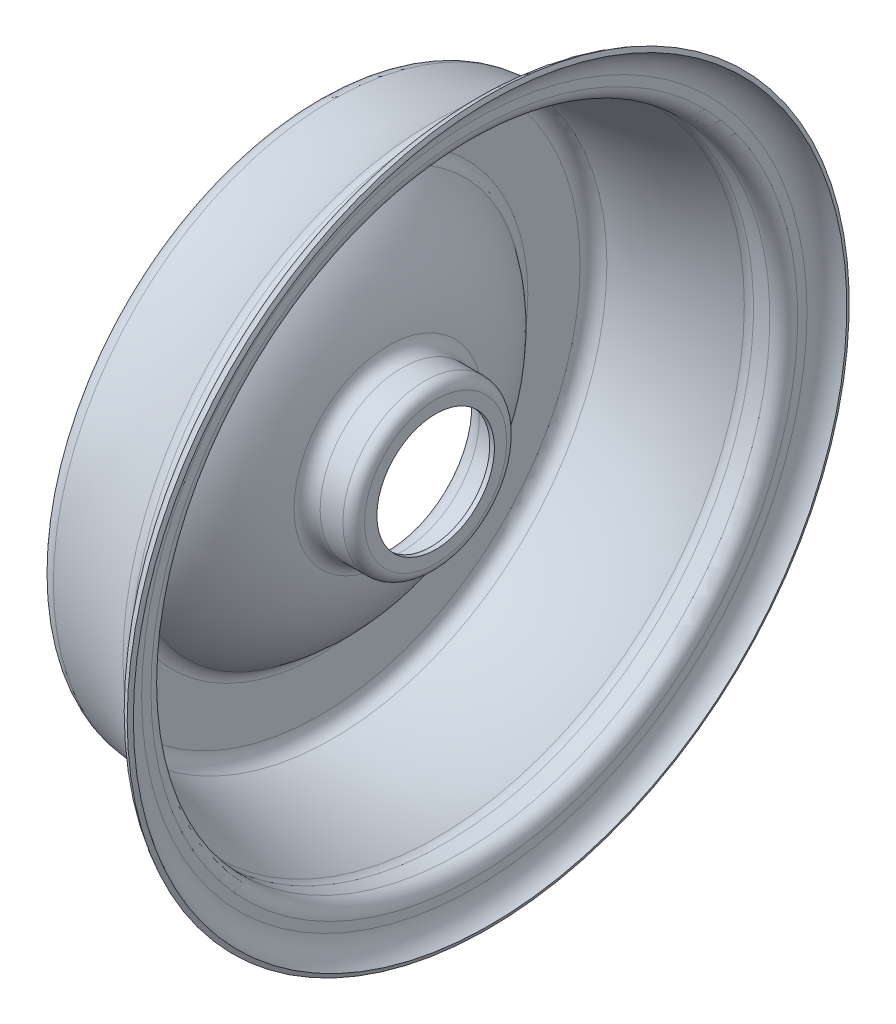
ISO-10303-21;
HEADER;
FILE_DESCRIPTION(('STEP AP214'),'2;1');
FILE_NAME('part.step','',(''),(''),'','','');
FILE_SCHEMA(('AUTOMOTIVE_DESIGN { 1 0 10303 214 1 1 1 1 }'));
ENDSEC;
DATA;
#1=APPLICATION_CONTEXT('core data for automotive mechanical design processes');
#2=APPLICATION_PROTOCOL_DEFINITION('international standard','automotive_design',2000,#1);
#3=PRODUCT_CONTEXT('',#1,'mechanical');
#4=PRODUCT('Part','Part','',(#3));
#5=PRODUCT_RELATED_PRODUCT_CATEGORY('part','',(#4));
#6=PRODUCT_DEFINITION_FORMATION('','',#4);
#7=PRODUCT_DEFINITION_CONTEXT('part definition',#1,'design');
#8=PRODUCT_DEFINITION('design','',#6,#7);
#9=PRODUCT_DEFINITION_SHAPE('','',#8);
#10=(LENGTH_UNIT() NAMED_UNIT(*) SI_UNIT(.MILLI.,.METRE.));
#11=(NAMED_UNIT(*) PLANE_ANGLE_UNIT() SI_UNIT($,.RADIAN.));
#12=(NAMED_UNIT(*) SI_UNIT($,.STERADIAN.) SOLID_ANGLE_UNIT());
#13=UNCERTAINTY_MEASURE_WITH_UNIT(LENGTH_MEASURE(1.E-05),#10,'distance_accuracy_value','');
#14=(GEOMETRIC_REPRESENTATION_CONTEXT(3) GLOBAL_UNCERTAINTY_ASSIGNED_CONTEXT((#13)) GLOBAL_UNIT_ASSIGNED_CONTEXT((#10,
#11,#12)) REPRESENTATION_CONTEXT('',''));
#15=CARTESIAN_POINT('',(0.,0.,0.));
#16=DIRECTION('',(0.,0.,1.));
#17=DIRECTION('',(1.,0.,0.));
#18=AXIS2_PLACEMENT_3D('',#15,#16,#17);
#19=CARTESIAN_POINT('',(0.,0.,0.));
#20=DIRECTION('',(-1.,0.,0.));
#21=DIRECTION('',(0.,0.,1.));
#22=AXIS2_PLACEMENT_3D('',#19,#20,#21);
#23=CYLINDRICAL_SURFACE('',#22,19.);
#24=CARTESIAN_POINT('',(39.,0.,0.));
#25=DIRECTION('',(-1.,0.,0.));
#26=DIRECTION('',(0.,0.,1.));
#27=AXIS2_PLACEMENT_3D('',#24,#25,#26);
#28=CIRCLE('',#27,19.);
#29=CARTESIAN_POINT('',(39.,0.,19.));
#30=VERTEX_POINT('',#29);
#31=EDGE_CURVE('E10',#30,#30,#28,.T.);
#32=ORIENTED_EDGE('',*,*,#31,.F.);
#33=EDGE_LOOP('',(#32));
#34=FACE_BOUND('',#33,.T.);
#35=CARTESIAN_POINT('',(37.5,0.,0.));
#36=DIRECTION('',(-1.,0.,0.));
#37=DIRECTION('',(0.,0.,1.));
#38=AXIS2_PLACEMENT_3D('',#35,#36,#37);
#39=CIRCLE('',#38,19.);
#40=CARTESIAN_POINT('',(37.5,0.,19.));
#41=VERTEX_POINT('',#40);
#42=EDGE_CURVE('E129',#41,#41,#39,.T.);
#43=ORIENTED_EDGE('',*,*,#42,.T.);
#44=EDGE_LOOP('',(#43));
#45=FACE_BOUND('',#44,.T.);
#46=ADVANCED_FACE('F35',(#34,#45),#23,.F.);
#47=CARTESIAN_POINT('',(39.,19.,0.));
#48=DIRECTION('',(-1.,0.,0.));
#49=DIRECTION('',(0.,0.,1.));
#50=AXIS2_PLACEMENT_3D('',#47,#48,#49);
#51=PLANE('',#50);
#52=CARTESIAN_POINT('',(39.,0.,0.));
#53=DIRECTION('',(-1.,0.,0.));
#54=DIRECTION('',(0.,0.,1.));
#55=AXIS2_PLACEMENT_3D('',#52,#53,#54);
#56=CIRCLE('',#55,23.);
#57=CARTESIAN_POINT('',(39.,0.,23.));
#58=VERTEX_POINT('',#57);
#59=EDGE_CURVE('E41',#58,#58,#56,.T.);
#60=ORIENTED_EDGE('',*,*,#59,.F.);
#61=EDGE_LOOP('',(#60));
#62=FACE_BOUND('',#61,.T.);
#63=ORIENTED_EDGE('',*,*,#31,.T.);
#64=EDGE_LOOP('',(#63));
#65=FACE_BOUND('',#64,.T.);
#66=ADVANCED_FACE('F298',(#62,#65),#51,.F.);
#67=CARTESIAN_POINT('',(35.5,0.,0.));
#68=DIRECTION('',(-1.,0.,0.));
#69=DIRECTION('',(0.,0.,1.));
#70=AXIS2_PLACEMENT_3D('',#67,#68,#69);
#71=TOROIDAL_SURFACE('',#70,23.,3.5);
#72=CARTESIAN_POINT('',(35.5,0.,0.));
#73=DIRECTION('',(-1.,0.,0.));
#74=DIRECTION('',(0.,0.,1.));
#75=AXIS2_PLACEMENT_3D('',#72,#73,#74);
#76=CIRCLE('',#75,26.5);
#77=CARTESIAN_POINT('',(35.5,0.,26.5));
#78=VERTEX_POINT('',#77);
#79=EDGE_CURVE('E45',#78,#78,#76,.T.);
#80=ORIENTED_EDGE('',*,*,#79,.F.);
#81=EDGE_LOOP('',(#80));
#82=FACE_BOUND('',#81,.T.);
#83=ORIENTED_EDGE('',*,*,#59,.T.);
#84=EDGE_LOOP('',(#83));
#85=FACE_BOUND('',#84,.T.);
#86=ADVANCED_FACE('F293',(#82,#85),#71,.T.);
#87=CARTESIAN_POINT('',(0.,0.,0.));
#88=DIRECTION('',(-1.,0.,0.));
#89=DIRECTION('',(0.,0.,1.));
#90=AXIS2_PLACEMENT_3D('',#87,#88,#89);
#91=CYLINDRICAL_SURFACE('',#90,26.5);
#92=CARTESIAN_POINT('',(28.1461783569531,0.,0.));
#93=DIRECTION('',(-1.,0.,0.));
#94=DIRECTION('',(0.,0.,1.));
#95=AXIS2_PLACEMENT_3D('',#92,#93,#94);
#96=CIRCLE('',#95,26.5);
#97=CARTESIAN_POINT('',(28.1461783569531,0.,26.5));
#98=VERTEX_POINT('',#97);
#99=EDGE_CURVE('E49',#98,#98,#96,.T.);
#100=ORIENTED_EDGE('',*,*,#99,.F.);
#101=EDGE_LOOP('',(#100));
#102=FACE_BOUND('',#101,.T.);
#103=ORIENTED_EDGE('',*,*,#79,.T.);
#104=EDGE_LOOP('',(#103));
#105=FACE_BOUND('',#104,.T.);
#106=ADVANCED_FACE('F287',(#102,#105),#91,.T.);
#107=CARTESIAN_POINT('',(28.1461783569531,0.,0.));
#108=DIRECTION('',(-1.,0.,0.));
#109=DIRECTION('',(0.,0.,1.));
#110=AXIS2_PLACEMENT_3D('',#107,#108,#109);
#111=TOROIDAL_SURFACE('',#110,31.,4.5);
#112=CARTESIAN_POINT('',(23.6773673362618,0.,0.));
#113=DIRECTION('',(-1.,0.,0.));
#114=DIRECTION('',(0.,0.,1.));
#115=AXIS2_PLACEMENT_3D('',#112,#113,#114);
#116=CIRCLE('',#115,30.4711067580803);
#117=CARTESIAN_POINT('',(23.6773673362618,0.,30.4711067580803));
#118=VERTEX_POINT('',#117);
#119=EDGE_CURVE('E54',#118,#118,#116,.T.);
#120=ORIENTED_EDGE('',*,*,#119,.F.);
#121=EDGE_LOOP('',(#120));
#122=FACE_BOUND('',#121,.T.);
#123=ORIENTED_EDGE('',*,*,#99,.T.);
#124=EDGE_LOOP('',(#123));
#125=FACE_BOUND('',#124,.T.);
#126=ADVANCED_FACE('F281',(#122,#125),#111,.F.);
#127=CARTESIAN_POINT('',(-22.55,0.,0.));
#128=DIRECTION('',(-1.,0.,0.));
#129=DIRECTION('',(0.,0.,1.));
#130=AXIS2_PLACEMENT_3D('',#127,#128,#129);
#131=DEGENERATE_TOROIDAL_SURFACE('',#130,25.,46.55,.T.);
#132=CARTESIAN_POINT('',(3.48334965719883,0.,0.));
#133=DIRECTION('',(-1.,0.,0.));
#134=DIRECTION('',(0.,0.,1.));
#135=AXIS2_PLACEMENT_3D('',#132,#133,#134);
#136=CIRCLE('',#135,63.5897292764024);
#137=CARTESIAN_POINT('',(3.48334965719883,0.,63.5897292764024));
#138=VERTEX_POINT('',#137);
#139=EDGE_CURVE('E57',#138,#138,#136,.T.);
#140=ORIENTED_EDGE('',*,*,#139,.F.);
#141=EDGE_LOOP('',(#140));
#142=FACE_BOUND('',#141,.T.);
#143=ORIENTED_EDGE('',*,*,#119,.T.);
#144=EDGE_LOOP('',(#143));
#145=FACE_BOUND('',#144,.T.);
#146=ADVANCED_FACE('F275',(#142,#145),#131,.T.);
#147=CARTESIAN_POINT('',(6.,0.,0.));
#148=DIRECTION('',(-1.,0.,0.));
#149=DIRECTION('',(0.,0.,1.));
#150=AXIS2_PLACEMENT_3D('',#147,#148,#149);
#151=TOROIDAL_SURFACE('',#150,67.3202079389977,4.5);
#152=CARTESIAN_POINT('',(1.5,0.,0.));
#153=DIRECTION('',(-1.,0.,0.));
#154=DIRECTION('',(0.,0.,1.));
#155=AXIS2_PLACEMENT_3D('',#152,#153,#154);
#156=CIRCLE('',#155,67.3202079389977);
#157=CARTESIAN_POINT('',(1.5,0.,67.3202079389977));
#158=VERTEX_POINT('',#157);
#159=EDGE_CURVE('E60',#158,#158,#156,.T.);
#160=ORIENTED_EDGE('',*,*,#159,.F.);
#161=EDGE_LOOP('',(#160));
#162=FACE_BOUND('',#161,.T.);
#163=ORIENTED_EDGE('',*,*,#139,.T.);
#164=EDGE_LOOP('',(#163));
#165=FACE_BOUND('',#164,.T.);
#166=ADVANCED_FACE('F269',(#162,#165),#151,.F.);
#167=CARTESIAN_POINT('',(1.5,67.3202079389977,0.));
#168=DIRECTION('',(-1.,0.,0.));
#169=DIRECTION('',(0.,0.,1.));
#170=AXIS2_PLACEMENT_3D('',#167,#168,#169);
#171=PLANE('',#170);
#172=CARTESIAN_POINT('',(1.5,0.,0.));
#173=DIRECTION('',(-1.,0.,0.));
#174=DIRECTION('',(0.,0.,1.));
#175=AXIS2_PLACEMENT_3D('',#172,#173,#174);
#176=CIRCLE('',#175,84.2231757353892);
#177=CARTESIAN_POINT('',(1.5,0.,84.2231757353892));
#178=VERTEX_POINT('',#177);
#179=EDGE_CURVE('E63',#178,#178,#176,.T.);
#180=ORIENTED_EDGE('',*,*,#179,.F.);
#181=EDGE_LOOP('',(#180));
#182=FACE_BOUND('',#181,.T.);
#183=ORIENTED_EDGE('',*,*,#159,.T.);
#184=EDGE_LOOP('',(#183));
#185=FACE_BOUND('',#184,.T.);
#186=ADVANCED_FACE('F263',(#182,#185),#171,.F.);
#187=CARTESIAN_POINT('',(6.,0.,0.));
#188=DIRECTION('',(-1.,0.,0.));
#189=DIRECTION('',(0.,0.,1.));
#190=AXIS2_PLACEMENT_3D('',#187,#188,#189);
#191=TOROIDAL_SURFACE('',#190,84.2231757353892,4.5);
#192=CARTESIAN_POINT('',(5.66569891554949,0.,0.));
#193=DIRECTION('',(-1.,0.,0.));
#194=DIRECTION('',(0.,0.,1.));
#195=AXIS2_PLACEMENT_3D('',#192,#193,#194);
#196=CIRCLE('',#195,88.7107410869953);
#197=CARTESIAN_POINT('',(5.66569891554949,0.,88.7107410869953));
#198=VERTEX_POINT('',#197);
#199=EDGE_CURVE('E66',#198,#198,#196,.T.);
#200=ORIENTED_EDGE('',*,*,#199,.F.);
#201=EDGE_LOOP('',(#200));
#202=FACE_BOUND('',#201,.T.);
#203=ORIENTED_EDGE('',*,*,#179,.T.);
#204=EDGE_LOOP('',(#203));
#205=FACE_BOUND('',#204,.T.);
#206=ADVANCED_FACE('F257',(#202,#205),#191,.F.);
#207=CARTESIAN_POINT('',(0.,0.,0.));
#208=DIRECTION('',(-1.,0.,0.));
#209=DIRECTION('',(0.,0.,1.));
#210=AXIS2_PLACEMENT_3D('',#207,#208,#209);
#211=TOROIDAL_SURFACE('',#210,164.765517241379,76.2655172413793);
#212=CARTESIAN_POINT('',(39.3801172320374,0.,0.));
#213=DIRECTION('',(-1.,0.,0.));
#214=DIRECTION('',(0.,0.,1.));
#215=AXIS2_PLACEMENT_3D('',#212,#213,#214);
#216=CIRCLE('',#215,99.4536845700623);
#217=CARTESIAN_POINT('',(39.3801172320374,0.,99.4536845700623));
#218=VERTEX_POINT('',#217);
#219=EDGE_CURVE('E69',#218,#218,#216,.T.);
#220=ORIENTED_EDGE('',*,*,#219,.F.);
#221=EDGE_LOOP('',(#220));
#222=FACE_BOUND('',#221,.T.);
#223=ORIENTED_EDGE('',*,*,#199,.T.);
#224=EDGE_LOOP('',(#223));
#225=FACE_BOUND('',#224,.T.);
#226=ADVANCED_FACE('F251',(#222,#225),#211,.T.);
#227=CARTESIAN_POINT('',(41.7037168607308,0.,0.));
#228=DIRECTION('',(-1.,0.,0.));
#229=DIRECTION('',(0.,0.,1.));
#230=AXIS2_PLACEMENT_3D('',#227,#228,#229);
#231=TOROIDAL_SURFACE('',#230,95.6,4.50000000000001);
#232=CARTESIAN_POINT('',(41.7037168607308,0.,0.));
#233=DIRECTION('',(-1.,0.,0.));
#234=DIRECTION('',(0.,0.,1.));
#235=AXIS2_PLACEMENT_3D('',#232,#233,#234);
#236=CIRCLE('',#235,100.1);
#237=CARTESIAN_POINT('',(41.7037168607308,0.,100.1));
#238=VERTEX_POINT('',#237);
#239=EDGE_CURVE('E72',#238,#238,#236,.T.);
#240=ORIENTED_EDGE('',*,*,#239,.F.);
#241=EDGE_LOOP('',(#240));
#242=FACE_BOUND('',#241,.T.);
#243=ORIENTED_EDGE('',*,*,#219,.T.);
#244=EDGE_LOOP('',(#243));
#245=FACE_BOUND('',#244,.T.);
#246=ADVANCED_FACE('F245',(#242,#245),#231,.F.);
#247=CARTESIAN_POINT('',(0.,0.,0.));
#248=DIRECTION('',(-1.,0.,0.));
#249=DIRECTION('',(0.,0.,1.));
#250=AXIS2_PLACEMENT_3D('',#247,#248,#249);
#251=CYLINDRICAL_SURFACE('',#250,100.1);
#252=CARTESIAN_POINT('',(47.,0.,0.));
#253=DIRECTION('',(-1.,0.,0.));
#254=DIRECTION('',(0.,0.,1.));
#255=AXIS2_PLACEMENT_3D('',#252,#253,#254);
#256=CIRCLE('',#255,100.1);
#257=CARTESIAN_POINT('',(47.,0.,100.1));
#258=VERTEX_POINT('',#257);
#259=EDGE_CURVE('E75',#258,#258,#256,.T.);
#260=ORIENTED_EDGE('',*,*,#259,.F.);
#261=EDGE_LOOP('',(#260));
#262=FACE_BOUND('',#261,.T.);
#263=ORIENTED_EDGE('',*,*,#239,.T.);
#264=EDGE_LOOP('',(#263));
#265=FACE_BOUND('',#264,.T.);
#266=ADVANCED_FACE('F239',(#262,#265),#251,.F.);
#267=CARTESIAN_POINT('',(47.,0.,0.));
#268=DIRECTION('',(-1.,0.,0.));
#269=DIRECTION('',(0.,0.,1.));
#270=AXIS2_PLACEMENT_3D('',#267,#268,#269);
#271=TOROIDAL_SURFACE('',#270,104.6,4.5);
#272=CARTESIAN_POINT('',(51.5,0.,0.));
#273=DIRECTION('',(-1.,0.,0.));
#274=DIRECTION('',(0.,0.,1.));
#275=AXIS2_PLACEMENT_3D('',#272,#273,#274);
#276=CIRCLE('',#275,104.6);
#277=CARTESIAN_POINT('',(51.5,0.,104.6));
#278=VERTEX_POINT('',#277);
#279=EDGE_CURVE('E78',#278,#278,#276,.T.);
#280=ORIENTED_EDGE('',*,*,#279,.F.);
#281=EDGE_LOOP('',(#280));
#282=FACE_BOUND('',#281,.T.);
#283=ORIENTED_EDGE('',*,*,#259,.T.);
#284=EDGE_LOOP('',(#283));
#285=FACE_BOUND('',#284,.T.);
#286=ADVANCED_FACE('F233',(#282,#285),#271,.T.);
#287=CARTESIAN_POINT('',(51.5,104.6,0.));
#288=DIRECTION('',(-1.,0.,0.));
#289=DIRECTION('',(0.,0.,1.));
#290=AXIS2_PLACEMENT_3D('',#287,#288,#289);
#291=PLANE('',#290);
#292=CARTESIAN_POINT('',(51.5,0.,0.));
#293=DIRECTION('',(-1.,0.,0.));
#294=DIRECTION('',(0.,0.,1.));
#295=AXIS2_PLACEMENT_3D('',#292,#293,#294);
#296=CIRCLE('',#295,107.6);
#297=CARTESIAN_POINT('',(51.5,0.,107.6));
#298=VERTEX_POINT('',#297);
#299=EDGE_CURVE('E81',#298,#298,#296,.T.);
#300=ORIENTED_EDGE('',*,*,#299,.F.);
#301=EDGE_LOOP('',(#300));
#302=FACE_BOUND('',#301,.T.);
#303=ORIENTED_EDGE('',*,*,#279,.T.);
#304=EDGE_LOOP('',(#303));
#305=FACE_BOUND('',#304,.T.);
#306=ADVANCED_FACE('F227',(#302,#305),#291,.F.);
#307=CARTESIAN_POINT('',(60.,0.,0.));
#308=DIRECTION('',(-1.,0.,0.));
#309=DIRECTION('',(0.,0.,1.));
#310=AXIS2_PLACEMENT_3D('',#307,#308,#309);
#311=TOROIDAL_SURFACE('',#310,107.6,8.5);
#312=CARTESIAN_POINT('',(56.6,0.,0.));
#313=DIRECTION('',(-1.,0.,0.));
#314=DIRECTION('',(0.,0.,1.));
#315=AXIS2_PLACEMENT_3D('',#312,#313,#314);
#316=CIRCLE('',#315,115.390378681425);
#317=CARTESIAN_POINT('',(56.6,0.,115.390378681425));
#318=VERTEX_POINT('',#317);
#319=EDGE_CURVE('E84',#318,#318,#316,.T.);
#320=ORIENTED_EDGE('',*,*,#319,.F.);
#321=EDGE_LOOP('',(#320));
#322=FACE_BOUND('',#321,.T.);
#323=ORIENTED_EDGE('',*,*,#299,.T.);
#324=EDGE_LOOP('',(#323));
#325=FACE_BOUND('',#324,.T.);
#326=ADVANCED_FACE('F221',(#322,#325),#311,.F.);
#327=CARTESIAN_POINT('',(56.6,0.,0.));
#328=DIRECTION('',(-1.,0.,0.));
#329=DIRECTION('',(0.,0.,1.));
#330=AXIS2_PLACEMENT_3D('',#327,#328,#329);
#331=CONICAL_SURFACE('',#330,115.390378681425,1.15927948072741);
#332=CARTESIAN_POINT('',(56.,0.,0.));
#333=DIRECTION('',(-1.,0.,0.));
#334=DIRECTION('',(0.,0.,1.));
#335=AXIS2_PLACEMENT_3D('',#332,#333,#334);
#336=CIRCLE('',#335,116.765151389912);
#337=CARTESIAN_POINT('',(56.,0.,116.765151389912));
#338=VERTEX_POINT('',#337);
#339=EDGE_CURVE('E87',#338,#338,#336,.T.);
#340=ORIENTED_EDGE('',*,*,#339,.F.);
#341=EDGE_LOOP('',(#340));
#342=FACE_BOUND('',#341,.T.);
#343=ORIENTED_EDGE('',*,*,#319,.T.);
#344=EDGE_LOOP('',(#343));
#345=FACE_BOUND('',#344,.T.);
#346=ADVANCED_FACE('F215',(#342,#345),#331,.T.);
#347=CARTESIAN_POINT('',(60.,0.,0.));
#348=DIRECTION('',(-1.,0.,0.));
#349=DIRECTION('',(0.,0.,1.));
#350=AXIS2_PLACEMENT_3D('',#347,#348,#349);
#351=TOROIDAL_SURFACE('',#350,107.6,10.);
#352=CARTESIAN_POINT('',(50.,0.,0.));
#353=DIRECTION('',(-1.,0.,0.));
#354=DIRECTION('',(0.,0.,1.));
#355=AXIS2_PLACEMENT_3D('',#352,#353,#354);
#356=CIRCLE('',#355,107.6);
#357=CARTESIAN_POINT('',(50.,0.,107.6));
#358=VERTEX_POINT('',#357);
#359=EDGE_CURVE('E90',#358,#358,#356,.T.);
#360=ORIENTED_EDGE('',*,*,#359,.F.);
#361=EDGE_LOOP('',(#360));
#362=FACE_BOUND('',#361,.T.);
#363=ORIENTED_EDGE('',*,*,#339,.T.);
#364=EDGE_LOOP('',(#363));
#365=FACE_BOUND('',#364,.T.);
#366=ADVANCED_FACE('F209',(#362,#365),#351,.T.);
#367=CARTESIAN_POINT('',(50.,104.6,0.));
#368=DIRECTION('',(1.,0.,0.));
#369=DIRECTION('',(0.,0.,-1.));
#370=AXIS2_PLACEMENT_3D('',#367,#368,#369);
#371=PLANE('',#370);
#372=CARTESIAN_POINT('',(50.,0.,0.));
#373=DIRECTION('',(-1.,0.,0.));
#374=DIRECTION('',(0.,0.,1.));
#375=AXIS2_PLACEMENT_3D('',#372,#373,#374);
#376=CIRCLE('',#375,104.6);
#377=CARTESIAN_POINT('',(50.,0.,104.6));
#378=VERTEX_POINT('',#377);
#379=EDGE_CURVE('E93',#378,#378,#376,.T.);
#380=ORIENTED_EDGE('',*,*,#379,.F.);
#381=EDGE_LOOP('',(#380));
#382=FACE_BOUND('',#381,.T.);
#383=ORIENTED_EDGE('',*,*,#359,.T.);
#384=EDGE_LOOP('',(#383));
#385=FACE_BOUND('',#384,.T.);
#386=ADVANCED_FACE('F203',(#382,#385),#371,.F.);
#387=CARTESIAN_POINT('',(47.,0.,0.));
#388=DIRECTION('',(-1.,0.,0.));
#389=DIRECTION('',(0.,0.,1.));
#390=AXIS2_PLACEMENT_3D('',#387,#388,#389);
#391=TOROIDAL_SURFACE('',#390,104.6,3.);
#392=CARTESIAN_POINT('',(47.,0.,0.));
#393=DIRECTION('',(-1.,0.,0.));
#394=DIRECTION('',(0.,0.,1.));
#395=AXIS2_PLACEMENT_3D('',#392,#393,#394);
#396=CIRCLE('',#395,101.6);
#397=CARTESIAN_POINT('',(47.,0.,101.6));
#398=VERTEX_POINT('',#397);
#399=EDGE_CURVE('E96',#398,#398,#396,.T.);
#400=ORIENTED_EDGE('',*,*,#399,.F.);
#401=EDGE_LOOP('',(#400));
#402=FACE_BOUND('',#401,.T.);
#403=ORIENTED_EDGE('',*,*,#379,.T.);
#404=EDGE_LOOP('',(#403));
#405=FACE_BOUND('',#404,.T.);
#406=ADVANCED_FACE('F197',(#402,#405),#391,.F.);
#407=CARTESIAN_POINT('',(0.,0.,0.));
#408=DIRECTION('',(-1.,0.,0.));
#409=DIRECTION('',(0.,0.,1.));
#410=AXIS2_PLACEMENT_3D('',#407,#408,#409);
#411=CYLINDRICAL_SURFACE('',#410,101.6);
#412=CARTESIAN_POINT('',(41.7037168607308,0.,0.));
#413=DIRECTION('',(-1.,0.,0.));
#414=DIRECTION('',(0.,0.,1.));
#415=AXIS2_PLACEMENT_3D('',#412,#413,#414);
#416=CIRCLE('',#415,101.6);
#417=CARTESIAN_POINT('',(41.7037168607308,0.,101.6));
#418=VERTEX_POINT('',#417);
#419=EDGE_CURVE('E99',#418,#418,#416,.T.);
#420=ORIENTED_EDGE('',*,*,#419,.F.);
#421=EDGE_LOOP('',(#420));
#422=FACE_BOUND('',#421,.T.);
#423=ORIENTED_EDGE('',*,*,#399,.T.);
#424=EDGE_LOOP('',(#423));
#425=FACE_BOUND('',#424,.T.);
#426=ADVANCED_FACE('F191',(#422,#425),#411,.T.);
#427=CARTESIAN_POINT('',(41.7037168607308,0.,0.));
#428=DIRECTION('',(-1.,0.,0.));
#429=DIRECTION('',(0.,0.,1.));
#430=AXIS2_PLACEMENT_3D('',#427,#428,#429);
#431=TOROIDAL_SURFACE('',#430,95.6,6.);
#432=CARTESIAN_POINT('',(38.605584022473,0.,0.));
#433=DIRECTION('',(-1.,0.,0.));
#434=DIRECTION('',(0.,0.,1.));
#435=AXIS2_PLACEMENT_3D('',#432,#433,#434);
#436=CIRCLE('',#435,100.738246093416);
#437=CARTESIAN_POINT('',(38.605584022473,0.,100.738246093416));
#438=VERTEX_POINT('',#437);
#439=EDGE_CURVE('E102',#438,#438,#436,.T.);
#440=ORIENTED_EDGE('',*,*,#439,.F.);
#441=EDGE_LOOP('',(#440));
#442=FACE_BOUND('',#441,.T.);
#443=ORIENTED_EDGE('',*,*,#419,.T.);
#444=EDGE_LOOP('',(#443));
#445=FACE_BOUND('',#444,.T.);
#446=ADVANCED_FACE('F185',(#442,#445),#431,.T.);
#447=CARTESIAN_POINT('',(0.,0.,0.));
#448=DIRECTION('',(-1.,0.,0.));
#449=DIRECTION('',(0.,0.,1.));
#450=AXIS2_PLACEMENT_3D('',#447,#448,#449);
#451=TOROIDAL_SURFACE('',#450,164.765517241379,74.7655172413793);
#452=CARTESIAN_POINT('',(5.55426522073265,0.,0.));
#453=DIRECTION('',(-1.,0.,0.));
#454=DIRECTION('',(0.,0.,1.));
#455=AXIS2_PLACEMENT_3D('',#452,#453,#454);
#456=CIRCLE('',#455,90.2065962041973);
#457=CARTESIAN_POINT('',(5.55426522073265,0.,90.2065962041973));
#458=VERTEX_POINT('',#457);
#459=EDGE_CURVE('E105',#458,#458,#456,.T.);
#460=ORIENTED_EDGE('',*,*,#459,.F.);
#461=EDGE_LOOP('',(#460));
#462=FACE_BOUND('',#461,.T.);
#463=ORIENTED_EDGE('',*,*,#439,.T.);
#464=EDGE_LOOP('',(#463));
#465=FACE_BOUND('',#464,.T.);
#466=ADVANCED_FACE('F179',(#462,#465),#451,.F.);
#467=CARTESIAN_POINT('',(6.,0.,0.));
#468=DIRECTION('',(-1.,0.,0.));
#469=DIRECTION('',(0.,0.,1.));
#470=AXIS2_PLACEMENT_3D('',#467,#468,#469);
#471=TOROIDAL_SURFACE('',#470,84.2231757353892,6.);
#472=CARTESIAN_POINT('',(0.,0.,0.));
#473=DIRECTION('',(-1.,0.,0.));
#474=DIRECTION('',(0.,0.,1.));
#475=AXIS2_PLACEMENT_3D('',#472,#473,#474);
#476=CIRCLE('',#475,84.2231757353892);
#477=CARTESIAN_POINT('',(0.,0.,84.2231757353892));
#478=VERTEX_POINT('',#477);
#479=EDGE_CURVE('E108',#478,#478,#476,.T.);
#480=ORIENTED_EDGE('',*,*,#479,.F.);
#481=EDGE_LOOP('',(#480));
#482=FACE_BOUND('',#481,.T.);
#483=ORIENTED_EDGE('',*,*,#459,.T.);
#484=EDGE_LOOP('',(#483));
#485=FACE_BOUND('',#484,.T.);
#486=ADVANCED_FACE('F173',(#482,#485),#471,.T.);
#487=CARTESIAN_POINT('',(0.,67.3202079389977,0.));
#488=DIRECTION('',(1.,0.,0.));
#489=DIRECTION('',(0.,0.,-1.));
#490=AXIS2_PLACEMENT_3D('',#487,#488,#489);
#491=PLANE('',#490);
#492=CARTESIAN_POINT('',(0.,0.,0.));
#493=DIRECTION('',(-1.,0.,0.));
#494=DIRECTION('',(0.,0.,1.));
#495=AXIS2_PLACEMENT_3D('',#492,#493,#494);
#496=CIRCLE('',#495,67.3202079389977);
#497=CARTESIAN_POINT('',(0.,0.,67.3202079389977));
#498=VERTEX_POINT('',#497);
#499=EDGE_CURVE('E111',#498,#498,#496,.T.);
#500=ORIENTED_EDGE('',*,*,#499,.F.);
#501=EDGE_LOOP('',(#500));
#502=FACE_BOUND('',#501,.T.);
#503=ORIENTED_EDGE('',*,*,#479,.T.);
#504=EDGE_LOOP('',(#503));
#505=FACE_BOUND('',#504,.T.);
#506=ADVANCED_FACE('F167',(#502,#505),#491,.F.);
#507=CARTESIAN_POINT('',(6.,0.,0.));
#508=DIRECTION('',(-1.,0.,0.));
#509=DIRECTION('',(0.,0.,1.));
#510=AXIS2_PLACEMENT_3D('',#507,#508,#509);
#511=TOROIDAL_SURFACE('',#510,67.3202079389977,6.);
#512=CARTESIAN_POINT('',(2.64446620959843,0.,0.));
#513=DIRECTION('',(-1.,0.,0.));
#514=DIRECTION('',(0.,0.,1.));
#515=AXIS2_PLACEMENT_3D('',#512,#513,#514);
#516=CIRCLE('',#515,62.3462363888706);
#517=CARTESIAN_POINT('',(2.64446620959843,0.,62.3462363888706));
#518=VERTEX_POINT('',#517);
#519=EDGE_CURVE('E114',#518,#518,#516,.T.);
#520=ORIENTED_EDGE('',*,*,#519,.F.);
#521=EDGE_LOOP('',(#520));
#522=FACE_BOUND('',#521,.T.);
#523=ORIENTED_EDGE('',*,*,#499,.T.);
#524=EDGE_LOOP('',(#523));
#525=FACE_BOUND('',#524,.T.);
#526=ADVANCED_FACE('F161',(#522,#525),#511,.T.);
#527=CARTESIAN_POINT('',(-22.55,0.,0.));
#528=DIRECTION('',(-1.,0.,0.));
#529=DIRECTION('',(0.,0.,1.));
#530=AXIS2_PLACEMENT_3D('',#527,#528,#529);
#531=DEGENERATE_TOROIDAL_SURFACE('',#530,25.,45.05,.T.);
#532=CARTESIAN_POINT('',(22.1877636626981,0.,0.));
#533=DIRECTION('',(-1.,0.,0.));
#534=DIRECTION('',(0.,0.,1.));
#535=AXIS2_PLACEMENT_3D('',#532,#533,#534);
#536=CIRCLE('',#535,30.2948090107738);
#537=CARTESIAN_POINT('',(22.1877636626981,0.,30.2948090107738));
#538=VERTEX_POINT('',#537);
#539=EDGE_CURVE('E117',#538,#538,#536,.T.);
#540=ORIENTED_EDGE('',*,*,#539,.F.);
#541=EDGE_LOOP('',(#540));
#542=FACE_BOUND('',#541,.T.);
#543=ORIENTED_EDGE('',*,*,#519,.T.);
#544=EDGE_LOOP('',(#543));
#545=FACE_BOUND('',#544,.T.);
#546=ADVANCED_FACE('F155',(#542,#545),#531,.F.);
#547=CARTESIAN_POINT('',(28.1461783569531,0.,0.));
#548=DIRECTION('',(-1.,0.,0.));
#549=DIRECTION('',(0.,0.,1.));
#550=AXIS2_PLACEMENT_3D('',#547,#548,#549);
#551=TOROIDAL_SURFACE('',#550,31.,6.);
#552=CARTESIAN_POINT('',(28.1461783569531,0.,0.));
#553=DIRECTION('',(-1.,0.,0.));
#554=DIRECTION('',(0.,0.,1.));
#555=AXIS2_PLACEMENT_3D('',#552,#553,#554);
#556=CIRCLE('',#555,25.);
#557=CARTESIAN_POINT('',(28.1461783569531,0.,25.));
#558=VERTEX_POINT('',#557);
#559=EDGE_CURVE('E120',#558,#558,#556,.T.);
#560=ORIENTED_EDGE('',*,*,#559,.F.);
#561=EDGE_LOOP('',(#560));
#562=FACE_BOUND('',#561,.T.);
#563=ORIENTED_EDGE('',*,*,#539,.T.);
#564=EDGE_LOOP('',(#563));
#565=FACE_BOUND('',#564,.T.);
#566=ADVANCED_FACE('F149',(#562,#565),#551,.T.);
#567=CARTESIAN_POINT('',(0.,0.,0.));
#568=DIRECTION('',(-1.,0.,0.));
#569=DIRECTION('',(0.,0.,1.));
#570=AXIS2_PLACEMENT_3D('',#567,#568,#569);
#571=CYLINDRICAL_SURFACE('',#570,25.);
#572=CARTESIAN_POINT('',(35.5,0.,0.));
#573=DIRECTION('',(-1.,0.,0.));
#574=DIRECTION('',(0.,0.,1.));
#575=AXIS2_PLACEMENT_3D('',#572,#573,#574);
#576=CIRCLE('',#575,25.);
#577=CARTESIAN_POINT('',(35.5,0.,25.));
#578=VERTEX_POINT('',#577);
#579=EDGE_CURVE('E123',#578,#578,#576,.T.);
#580=ORIENTED_EDGE('',*,*,#579,.F.);
#581=EDGE_LOOP('',(#580));
#582=FACE_BOUND('',#581,.T.);
#583=ORIENTED_EDGE('',*,*,#559,.T.);
#584=EDGE_LOOP('',(#583));
#585=FACE_BOUND('',#584,.T.);
#586=ADVANCED_FACE('F143',(#582,#585),#571,.F.);
#587=CARTESIAN_POINT('',(35.5,0.,0.));
#588=DIRECTION('',(-1.,0.,0.));
#589=DIRECTION('',(0.,0.,1.));
#590=AXIS2_PLACEMENT_3D('',#587,#588,#589);
#591=TOROIDAL_SURFACE('',#590,23.,2.);
#592=CARTESIAN_POINT('',(37.5,0.,0.));
#593=DIRECTION('',(-1.,0.,0.));
#594=DIRECTION('',(0.,0.,1.));
#595=AXIS2_PLACEMENT_3D('',#592,#593,#594);
#596=CIRCLE('',#595,23.);
#597=CARTESIAN_POINT('',(37.5,0.,23.));
#598=VERTEX_POINT('',#597);
#599=EDGE_CURVE('E126',#598,#598,#596,.T.);
#600=ORIENTED_EDGE('',*,*,#599,.F.);
#601=EDGE_LOOP('',(#600));
#602=FACE_BOUND('',#601,.T.);
#603=ORIENTED_EDGE('',*,*,#579,.T.);
#604=EDGE_LOOP('',(#603));
#605=FACE_BOUND('',#604,.T.);
#606=ADVANCED_FACE('F137',(#602,#605),#591,.F.);
#607=CARTESIAN_POINT('',(37.5,19.,0.));
#608=DIRECTION('',(1.,0.,0.));
#609=DIRECTION('',(0.,0.,-1.));
#610=AXIS2_PLACEMENT_3D('',#607,#608,#609);
#611=PLANE('',#610);
#612=ORIENTED_EDGE('',*,*,#42,.F.);
#613=EDGE_LOOP('',(#612));
#614=FACE_BOUND('',#613,.T.);
#615=ORIENTED_EDGE('',*,*,#599,.T.);
#616=EDGE_LOOP('',(#615));
#617=FACE_BOUND('',#616,.T.);
#618=ADVANCED_FACE('F134',(#614,#617),#611,.F.);
#619=CLOSED_SHELL('',(#46,#66,#86,#106,#126,#146,#166,#186,#206,#226,#246,#266,#286,#306,#326,
#346,#366,#386,#406,#426,#446,#466,#486,#506,#526,#546,#566,#586,#606,#618));
#620=MANIFOLD_SOLID_BREP('B2',#619);
#621=ADVANCED_BREP_SHAPE_REPRESENTATION('',(#18,#620),#14);
#622=SHAPE_DEFINITION_REPRESENTATION(#9,#621);
ENDSEC;
END-ISO-10303-21;
